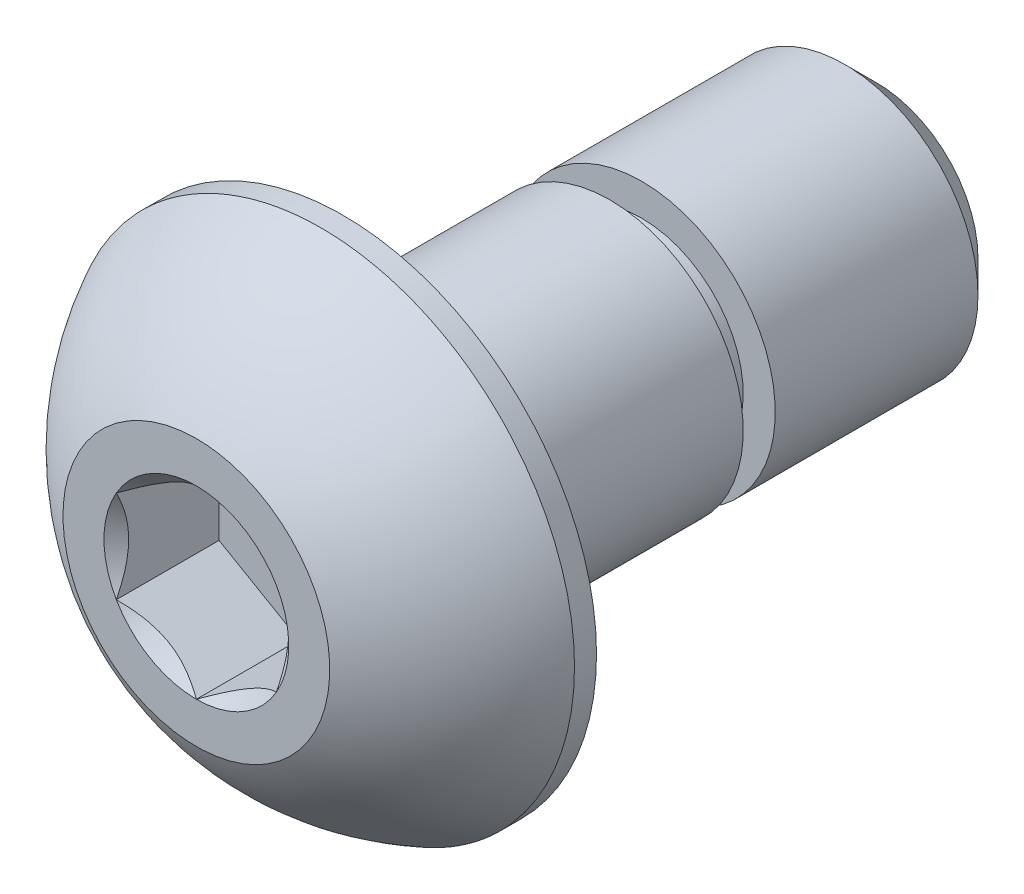
ISO-10303-21;
HEADER;
FILE_DESCRIPTION(('STEP AP214'),'2;1');
FILE_NAME('part.step','',(''),(''),'','','');
FILE_SCHEMA(('AUTOMOTIVE_DESIGN { 1 0 10303 214 1 1 1 1 }'));
ENDSEC;
DATA;
#1=APPLICATION_CONTEXT('core data for automotive mechanical design processes');
#2=APPLICATION_PROTOCOL_DEFINITION('international standard','automotive_design',2000,#1);
#3=PRODUCT_CONTEXT('',#1,'mechanical');
#4=PRODUCT('Part','Part','',(#3));
#5=PRODUCT_RELATED_PRODUCT_CATEGORY('part','',(#4));
#6=PRODUCT_DEFINITION_FORMATION('','',#4);
#7=PRODUCT_DEFINITION_CONTEXT('part definition',#1,'design');
#8=PRODUCT_DEFINITION('design','',#6,#7);
#9=PRODUCT_DEFINITION_SHAPE('','',#8);
#10=(LENGTH_UNIT() NAMED_UNIT(*) SI_UNIT(.MILLI.,.METRE.));
#11=(NAMED_UNIT(*) PLANE_ANGLE_UNIT() SI_UNIT($,.RADIAN.));
#12=(NAMED_UNIT(*) SI_UNIT($,.STERADIAN.) SOLID_ANGLE_UNIT());
#13=UNCERTAINTY_MEASURE_WITH_UNIT(LENGTH_MEASURE(1.E-05),#10,'distance_accuracy_value','');
#14=(GEOMETRIC_REPRESENTATION_CONTEXT(3) GLOBAL_UNCERTAINTY_ASSIGNED_CONTEXT((#13)) GLOBAL_UNIT_ASSIGNED_CONTEXT((#10,
#11,#12)) REPRESENTATION_CONTEXT('',''));
#15=CARTESIAN_POINT('',(0.,0.,0.));
#16=DIRECTION('',(0.,0.,1.));
#17=DIRECTION('',(1.,0.,0.));
#18=AXIS2_PLACEMENT_3D('',#15,#16,#17);
#19=CARTESIAN_POINT('',(1.5,-0.866025403784438,-1.925));
#20=DIRECTION('',(0.,0.,1.));
#21=DIRECTION('',(1.,0.,0.));
#22=AXIS2_PLACEMENT_3D('',#19,#20,#21);
#23=PLANE('',#22);
#24=DIRECTION('',(0.,-1.,0.));
#25=VECTOR('',#24,1.);
#26=CARTESIAN_POINT('',(-1.5,0.866025403784438,-1.925));
#27=LINE('',#26,#25);
#28=CARTESIAN_POINT('',(-1.5,0.866025403784439,-1.925));
#29=VERTEX_POINT('',#28);
#30=CARTESIAN_POINT('',(-1.5,-0.866025403784439,-1.925));
#31=VERTEX_POINT('',#30);
#32=EDGE_CURVE('E67',#29,#31,#27,.T.);
#33=ORIENTED_EDGE('',*,*,#32,.T.);
#34=DIRECTION('',(0.866025403784439,-0.5,0.));
#35=VECTOR('',#34,1.);
#36=CARTESIAN_POINT('',(-1.5,-0.866025403784439,-1.925));
#37=LINE('',#36,#35);
#38=CARTESIAN_POINT('',(0.,-1.73205080756888,-1.925));
#39=VERTEX_POINT('',#38);
#40=EDGE_CURVE('E81',#31,#39,#37,.T.);
#41=ORIENTED_EDGE('',*,*,#40,.T.);
#42=DIRECTION('',(0.866025403784438,0.5,0.));
#43=VECTOR('',#42,1.);
#44=CARTESIAN_POINT('',(0.,-1.73205080756888,-1.925));
#45=LINE('',#44,#43);
#46=CARTESIAN_POINT('',(1.5,-0.86602540378444,-1.925));
#47=VERTEX_POINT('',#46);
#48=EDGE_CURVE('E84',#39,#47,#45,.T.);
#49=ORIENTED_EDGE('',*,*,#48,.T.);
#50=DIRECTION('',(0.,1.,0.));
#51=VECTOR('',#50,1.);
#52=CARTESIAN_POINT('',(1.5,-0.866025403784438,-1.925));
#53=LINE('',#52,#51);
#54=CARTESIAN_POINT('',(1.5,0.866025403784439,-1.925));
#55=VERTEX_POINT('',#54);
#56=EDGE_CURVE('E93',#47,#55,#53,.T.);
#57=ORIENTED_EDGE('',*,*,#56,.T.);
#58=DIRECTION('',(-0.866025403784439,0.5,0.));
#59=VECTOR('',#58,1.);
#60=CARTESIAN_POINT('',(1.5,0.866025403784439,-1.925));
#61=LINE('',#60,#59);
#62=CARTESIAN_POINT('',(0.,1.73205080756888,-1.925));
#63=VERTEX_POINT('',#62);
#64=EDGE_CURVE('E293',#55,#63,#61,.T.);
#65=ORIENTED_EDGE('',*,*,#64,.T.);
#66=DIRECTION('',(-0.866025403784438,-0.5,0.));
#67=VECTOR('',#66,1.);
#68=CARTESIAN_POINT('',(0.,1.73205080756888,-1.925));
#69=LINE('',#68,#67);
#70=EDGE_CURVE('E72',#63,#29,#69,.T.);
#71=ORIENTED_EDGE('',*,*,#70,.T.);
#72=EDGE_LOOP('',(#33,#41,#49,#57,#65,#71));
#73=FACE_BOUND('',#72,.T.);
#74=ADVANCED_FACE('F17',(#73),#23,.T.);
#75=CARTESIAN_POINT('',(-1.5,-0.866025403784439,-1.925));
#76=DIRECTION('',(-0.5,-0.866025403784439,0.));
#77=DIRECTION('',(0.866025403784439,-0.5,0.));
#78=AXIS2_PLACEMENT_3D('',#75,#76,#77);
#79=PLANE('',#78);
#80=CARTESIAN_POINT('',(-1.50000000002453,-0.866025403770049,-3.49737783956075E-11));
#81=CARTESIAN_POINT('',(-1.44844426727117,-0.895791119953617,-0.0297371504849998));
#82=CARTESIAN_POINT('',(-1.39602652187328,-0.926054519369462,-0.05772749973321));
#83=CARTESIAN_POINT('',(-1.28914135977816,-0.987764696477501,-0.108976634295228));
#84=CARTESIAN_POINT('',(-1.23466378385068,-1.01921733960401,-0.132206913925155));
#85=CARTESIAN_POINT('',(-1.12481242363947,-1.08264005199279,-0.172000539063643));
#86=CARTESIAN_POINT('',(-1.06946660011449,-1.11459397810346,-0.188663877355987));
#87=CARTESIAN_POINT('',(-0.95755685533188,-1.17920509937865,-0.214336924391903));
#88=CARTESIAN_POINT('',(-0.900996350293105,-1.21186032218828,-0.223365789908325));
#89=CARTESIAN_POINT('',(-0.803509072843295,-1.26814462806649,-0.231512589340654));
#90=CARTESIAN_POINT('',(-0.762708138141556,-1.29170105869973,-0.232718117543908));
#91=CARTESIAN_POINT('',(-0.68117834074718,-1.33877230917235,-0.230683861819339));
#92=CARTESIAN_POINT('',(-0.640449495964758,-1.36228711867126,-0.22744309593466));
#93=CARTESIAN_POINT('',(-0.559384065201953,-1.40909026694414,-0.216702694706976));
#94=CARTESIAN_POINT('',(-0.519047879504411,-1.4323783746147,-0.20919909909419));
#95=CARTESIAN_POINT('',(-0.439052551258333,-1.47856369891149,-0.19034052638936));
#96=CARTESIAN_POINT('',(-0.399393706909127,-1.50146074337225,-0.178983896683506));
#97=CARTESIAN_POINT('',(-0.297850129661508,-1.56008695503064,-0.145281418581616));
#98=CARTESIAN_POINT('',(-0.236594120185608,-1.59545312859103,-0.120399016466317));
#99=CARTESIAN_POINT('',(-0.146523888893023,-1.64745520087378,-0.0783962697862533));
#100=CARTESIAN_POINT('',(-0.116842951449675,-1.6645914980965,-0.0636393457173693));
#101=CARTESIAN_POINT('',(-0.058026631022432,-1.69854911652791,-0.0327784720806822));
#102=CARTESIAN_POINT('',(-0.0288909964375007,-1.71537058299853,-0.0166751634684281));
#103=CARTESIAN_POINT('',(2.46569689539214E-11,-1.73205080758311,-3.50665873931199E-11));
#104=B_SPLINE_CURVE_WITH_KNOTS('',3,(#80,#81,#82,#83,#84,#85,#86,#87,#88,#89,#90,#91,#92,#93,
#94,#95,#96,#97,#98,#99,#100,#101,#102,#103),.UNSPECIFIED.,.F.,.F.,(4,2,2,2,2,2,2,2,2,2,2,4),
(0.,0.199774419910088,0.400712312277699,0.598459990337993,0.795709985707601,0.936894690871222,
1.07811058146816,1.21945788001607,1.36086588096647,1.58533909988034,1.69726364731887,
1.80913521242832),.UNSPECIFIED.);
#105=CARTESIAN_POINT('',(-1.50000000002135,-0.866025403796765,-2.4650955516094E-11));
#106=VERTEX_POINT('',#105);
#107=CARTESIAN_POINT('',(-3.03586137356069E-11,-1.73205080760065,-1.75293180706268E-11));
#108=VERTEX_POINT('',#107);
#109=EDGE_CURVE('E20',#106,#108,#104,.T.);
#110=ORIENTED_EDGE('',*,*,#109,.T.);
#111=DIRECTION('',(0.,0.,1.));
#112=VECTOR('',#111,1.);
#113=CARTESIAN_POINT('',(0.,-1.73205080756888,-1.925));
#114=LINE('',#113,#112);
#115=EDGE_CURVE('E88',#108,#39,#114,.F.);
#116=ORIENTED_EDGE('',*,*,#115,.T.);
#117=ORIENTED_EDGE('',*,*,#40,.F.);
#118=DIRECTION('',(0.,0.,1.));
#119=VECTOR('',#118,1.);
#120=CARTESIAN_POINT('',(-1.5,-0.866025403784439,-1.925));
#121=LINE('',#120,#119);
#122=EDGE_CURVE('E59',#31,#106,#121,.T.);
#123=ORIENTED_EDGE('',*,*,#122,.T.);
#124=EDGE_LOOP('',(#110,#116,#117,#123));
#125=FACE_BOUND('',#124,.T.);
#126=ADVANCED_FACE('F89',(#125),#79,.F.);
#127=CARTESIAN_POINT('',(0.,-1.73205080756888,-1.925));
#128=DIRECTION('',(0.5,-0.866025403784438,0.));
#129=DIRECTION('',(0.866025403784438,0.5,0.));
#130=AXIS2_PLACEMENT_3D('',#127,#128,#129);
#131=PLANE('',#130);
#132=CARTESIAN_POINT('',(-2.4727404427812E-11,-1.73205080758293,-3.49716199394019E-11));
#133=CARTESIAN_POINT('',(0.0515557327287643,-1.70228509139958,-0.0297371504849976));
#134=CARTESIAN_POINT('',(0.103973478126705,-1.67202169198382,-0.0577274997332079));
#135=CARTESIAN_POINT('',(0.210858640221864,-1.61031151487585,-0.108976634295226));
#136=CARTESIAN_POINT('',(0.26533621614933,-1.57885887174931,-0.132206913925153));
#137=CARTESIAN_POINT('',(0.375187576360525,-1.51543615936052,-0.172000539063641));
#138=CARTESIAN_POINT('',(0.430533399885509,-1.48348223324986,-0.188663877355985));
#139=CARTESIAN_POINT('',(0.542443144668123,-1.41887111197467,-0.214336924391901));
#140=CARTESIAN_POINT('',(0.599003649706897,-1.38621588916504,-0.223365789908323));
#141=CARTESIAN_POINT('',(0.696490927156707,-1.32993158328682,-0.231512589340651));
#142=CARTESIAN_POINT('',(0.737291861858446,-1.30637515265359,-0.232718117543906));
#143=CARTESIAN_POINT('',(0.818821659252822,-1.25930390218097,-0.230683861819337));
#144=CARTESIAN_POINT('',(0.859550504035244,-1.23578909268205,-0.227443095934657));
#145=CARTESIAN_POINT('',(0.940615934798049,-1.18898594440918,-0.216702694706973));
#146=CARTESIAN_POINT('',(0.980952120495592,-1.16569783673862,-0.209199099094188));
#147=CARTESIAN_POINT('',(1.06094744874167,-1.11951251244183,-0.190340526389357));
#148=CARTESIAN_POINT('',(1.10060629309088,-1.09661546798107,-0.178983896683504));
#149=CARTESIAN_POINT('',(1.20214987033849,-1.03798925632268,-0.145281418581613));
#150=CARTESIAN_POINT('',(1.26340587981439,-1.00262308276228,-0.120399016466315));
#151=CARTESIAN_POINT('',(1.35347611110698,-0.950621010479539,-0.0783962697862517));
#152=CARTESIAN_POINT('',(1.38315704855033,-0.933484713256821,-0.063639345717368));
#153=CARTESIAN_POINT('',(1.44197336897757,-0.89952709482541,-0.0327784720806814));
#154=CARTESIAN_POINT('',(1.4711090035625,-0.882705628354789,-0.0166751634684275));
#155=CARTESIAN_POINT('',(1.50000000002466,-0.866025403770207,-3.5066233129564E-11));
#156=B_SPLINE_CURVE_WITH_KNOTS('',3,(#132,#133,#134,#135,#136,#137,#138,#139,#140,#141,#142,
#143,#144,#145,#146,#147,#148,#149,#150,#151,#152,#153,#154,#155),.UNSPECIFIED.,.F.,.F.,(4,2,2,
2,2,2,2,2,2,2,2,4),(0.,0.199774419910088,0.400712312277699,0.598459990337993,0.795709985707601,
0.936894690871222,1.07811058146816,1.21945788001607,1.36086588096647,1.58533909988034,
1.69726364731887,1.80913521242832),.UNSPECIFIED.);
#157=CARTESIAN_POINT('',(1.50000000001233,-0.866025403826621,-1.75289960884086E-11));
#158=VERTEX_POINT('',#157);
#159=EDGE_CURVE('E219',#108,#158,#156,.T.);
#160=ORIENTED_EDGE('',*,*,#159,.T.);
#161=DIRECTION('',(0.,0.,-1.));
#162=VECTOR('',#161,1.);
#163=CARTESIAN_POINT('',(1.5,-0.866025403784439,-1.925));
#164=LINE('',#163,#162);
#165=EDGE_CURVE('E97',#158,#47,#164,.T.);
#166=ORIENTED_EDGE('',*,*,#165,.T.);
#167=ORIENTED_EDGE('',*,*,#48,.F.);
#168=ORIENTED_EDGE('',*,*,#115,.F.);
#169=EDGE_LOOP('',(#160,#166,#167,#168));
#170=FACE_BOUND('',#169,.T.);
#171=ADVANCED_FACE('F95',(#170),#131,.F.);
#172=CARTESIAN_POINT('',(1.5,-0.866025403784438,-1.925));
#173=DIRECTION('',(1.,0.,0.));
#174=DIRECTION('',(0.,0.,-1.));
#175=AXIS2_PLACEMENT_3D('',#172,#173,#174);
#176=PLANE('',#175);
#177=CARTESIAN_POINT('',(1.4999999999998,-0.866025403812882,-3.49731948477309E-11));
#178=CARTESIAN_POINT('',(1.49999999999993,-0.806493971458482,-0.0297371504859724));
#179=CARTESIAN_POINT('',(1.49999999999998,-0.745967172639481,-0.0577274997356717));
#180=CARTESIAN_POINT('',(1.50000000000002,-0.622546818448653,-0.108976634302055));
#181=CARTESIAN_POINT('',(1.50000000000001,-0.559641532208188,-0.132206913934863));
#182=CARTESIAN_POINT('',(1.5,-0.432796107455125,-0.172000539080811));
#183=CARTESIAN_POINT('',(1.5,-0.368888255245699,-0.188663877377684));
#184=CARTESIAN_POINT('',(1.5,-0.239666012718551,-0.214336924424236));
#185=CARTESIAN_POINT('',(1.5,-0.174355567110583,-0.223365789946761));
#186=CARTESIAN_POINT('',(1.5,-0.0617869553803685,-0.231512589389946));
#187=CARTESIAN_POINT('',(1.5,-0.0146740941290635,-0.232718117598397));
#188=CARTESIAN_POINT('',(1.5,0.0794684067864022,-0.230683861885897));
#189=CARTESIAN_POINT('',(1.5,0.126498025769628,-0.227443096008093));
#190=CARTESIAN_POINT('',(1.5,0.220104322286849,-0.216702694795371));
#191=CARTESIAN_POINT('',(1.5,0.266680537614033,-0.209199099190673));
#192=CARTESIAN_POINT('',(1.5,0.359051186180353,-0.190340526502742));
#193=CARTESIAN_POINT('',(1.5,0.404845275088565,-0.178983896805698));
#194=CARTESIAN_POINT('',(1.5,0.522097698449398,-0.145281418704612));
#195=CARTESIAN_POINT('',(1.5,0.592830045625335,-0.120399016572433));
#196=CARTESIAN_POINT('',(1.5,0.69683419026976,-0.0783962698582895));
#197=CARTESIAN_POINT('',(1.5,0.731106784740956,-0.0636393457765502));
#198=CARTESIAN_POINT('',(1.5,0.799022021654026,-0.0327784721118594));
#199=CARTESIAN_POINT('',(1.5,0.832664954619755,-0.0166751634844621));
#200=CARTESIAN_POINT('',(1.5,0.866025403812908,-3.50673015597961E-11));
#201=B_SPLINE_CURVE_WITH_KNOTS('',3,(#177,#178,#179,#180,#181,#182,#183,#184,#185,#186,#187,
#188,#189,#190,#191,#192,#193,#194,#195,#196,#197,#198,#199,#200),.UNSPECIFIED.,.F.,.F.,(4,2,2,
2,2,2,2,2,2,2,2,4),(0.,0.199774419877746,0.400712312213007,0.598459990242251,0.795709985580833,
0.936894690699464,1.07811058125136,1.21945787975417,1.36086588065946,1.58533909974464,
1.69726364726936,1.80913521246463),.UNSPECIFIED.);
#202=CARTESIAN_POINT('',(1.5000000000427,0.866025403774031,-1.75296333077756E-11));
#203=VERTEX_POINT('',#202);
#204=EDGE_CURVE('E198',#158,#203,#201,.T.);
#205=ORIENTED_EDGE('',*,*,#204,.T.);
#206=DIRECTION('',(0.,0.,1.));
#207=VECTOR('',#206,1.);
#208=CARTESIAN_POINT('',(1.5,0.866025403784439,-1.925));
#209=LINE('',#208,#207);
#210=EDGE_CURVE('E290',#203,#55,#209,.F.);
#211=ORIENTED_EDGE('',*,*,#210,.T.);
#212=ORIENTED_EDGE('',*,*,#56,.F.);
#213=ORIENTED_EDGE('',*,*,#165,.F.);
#214=EDGE_LOOP('',(#205,#211,#212,#213));
#215=FACE_BOUND('',#214,.T.);
#216=ADVANCED_FACE('F188',(#215),#176,.F.);
#217=CARTESIAN_POINT('',(1.5,0.866025403784439,-1.925));
#218=DIRECTION('',(0.5,0.866025403784439,0.));
#219=DIRECTION('',(-0.866025403784439,0.5,0.));
#220=AXIS2_PLACEMENT_3D('',#217,#218,#219);
#221=PLANE('',#220);
#222=CARTESIAN_POINT('',(1.50000000002453,0.866025403770048,-3.4973253111955E-11));
#223=CARTESIAN_POINT('',(1.44844426727117,0.895791119953617,-0.0297371504849995));
#224=CARTESIAN_POINT('',(1.39602652187328,0.926054519369461,-0.0577274997332099));
#225=CARTESIAN_POINT('',(1.28914135977816,0.987764696477501,-0.108976634295228));
#226=CARTESIAN_POINT('',(1.23466378385068,1.01921733960401,-0.132206913925156));
#227=CARTESIAN_POINT('',(1.12481242363947,1.08264005199279,-0.172000539063644));
#228=CARTESIAN_POINT('',(1.06946660011449,1.11459397810346,-0.188663877355987));
#229=CARTESIAN_POINT('',(0.95755685533188,1.17920509937865,-0.214336924391904));
#230=CARTESIAN_POINT('',(0.900996350293105,1.21186032218828,-0.223365789908325));
#231=CARTESIAN_POINT('',(0.803509072843295,1.26814462806649,-0.231512589340654));
#232=CARTESIAN_POINT('',(0.762708138141556,1.29170105869973,-0.232718117543908));
#233=CARTESIAN_POINT('',(0.68117834074718,1.33877230917235,-0.230683861819339));
#234=CARTESIAN_POINT('',(0.640449495964758,1.36228711867126,-0.22744309593466));
#235=CARTESIAN_POINT('',(0.559384065201953,1.40909026694414,-0.216702694706976));
#236=CARTESIAN_POINT('',(0.51904787950441,1.4323783746147,-0.20919909909419));
#237=CARTESIAN_POINT('',(0.439052551258333,1.47856369891149,-0.19034052638936));
#238=CARTESIAN_POINT('',(0.399393706909126,1.50146074337225,-0.178983896683506));
#239=CARTESIAN_POINT('',(0.297850129661508,1.56008695503064,-0.145281418581616));
#240=CARTESIAN_POINT('',(0.236594120185608,1.59545312859103,-0.120399016466317));
#241=CARTESIAN_POINT('',(0.146523888893023,1.64745520087378,-0.0783962697862533));
#242=CARTESIAN_POINT('',(0.116842951449675,1.6645914980965,-0.0636393457173695));
#243=CARTESIAN_POINT('',(0.0580266310224324,1.69854911652791,-0.0327784720806825));
#244=CARTESIAN_POINT('',(0.0288909964375013,1.71537058299853,-0.0166751634684285));
#245=CARTESIAN_POINT('',(-2.46561764620561E-11,1.73205080758311,-3.50669956446036E-11));
#246=B_SPLINE_CURVE_WITH_KNOTS('',3,(#222,#223,#224,#225,#226,#227,#228,#229,#230,#231,#232,
#233,#234,#235,#236,#237,#238,#239,#240,#241,#242,#243,#244,#245),.UNSPECIFIED.,.F.,.F.,(4,2,2,
2,2,2,2,2,2,2,2,4),(0.,0.199774419910088,0.400712312277699,0.598459990337994,0.795709985707602,
0.936894690871222,1.07811058146816,1.21945788001607,1.36086588096647,1.58533909988034,
1.69726364731887,1.80913521242832),.UNSPECIFIED.);
#247=CARTESIAN_POINT('',(3.03595659452686E-11,1.73205080760065,-1.75295301999691E-11));
#248=VERTEX_POINT('',#247);
#249=EDGE_CURVE('E192',#203,#248,#246,.T.);
#250=ORIENTED_EDGE('',*,*,#249,.T.);
#251=DIRECTION('',(0.,0.,1.));
#252=VECTOR('',#251,1.);
#253=CARTESIAN_POINT('',(0.,1.73205080756888,-1.925));
#254=LINE('',#253,#252);
#255=EDGE_CURVE('E285',#248,#63,#254,.F.);
#256=ORIENTED_EDGE('',*,*,#255,.T.);
#257=ORIENTED_EDGE('',*,*,#64,.F.);
#258=ORIENTED_EDGE('',*,*,#210,.F.);
#259=EDGE_LOOP('',(#250,#256,#257,#258));
#260=FACE_BOUND('',#259,.T.);
#261=ADVANCED_FACE('F184',(#260),#221,.F.);
#262=CARTESIAN_POINT('',(0.,1.73205080756888,-1.925));
#263=DIRECTION('',(-0.5,0.866025403784438,0.));
#264=DIRECTION('',(-0.866025403784438,-0.5,0.));
#265=AXIS2_PLACEMENT_3D('',#262,#263,#264);
#266=PLANE('',#265);
#267=CARTESIAN_POINT('',(2.47285824502275E-11,1.73205080758293,-3.4971456143468E-11));
#268=CARTESIAN_POINT('',(-0.0515557327287631,1.70228509139958,-0.0297371504849978));
#269=CARTESIAN_POINT('',(-0.103973478126704,1.67202169198382,-0.057727499733208));
#270=CARTESIAN_POINT('',(-0.210858640221863,1.61031151487585,-0.108976634295226));
#271=CARTESIAN_POINT('',(-0.265336216149329,1.57885887174931,-0.132206913925153));
#272=CARTESIAN_POINT('',(-0.375187576360524,1.51543615936052,-0.172000539063641));
#273=CARTESIAN_POINT('',(-0.430533399885509,1.48348223324986,-0.188663877355985));
#274=CARTESIAN_POINT('',(-0.542443144668122,1.41887111197467,-0.214336924391902));
#275=CARTESIAN_POINT('',(-0.599003649706897,1.38621588916503,-0.223365789908323));
#276=CARTESIAN_POINT('',(-0.696490927156706,1.32993158328682,-0.231512589340652));
#277=CARTESIAN_POINT('',(-0.737291861858445,1.30637515265359,-0.232718117543906));
#278=CARTESIAN_POINT('',(-0.818821659252821,1.25930390218097,-0.230683861819337));
#279=CARTESIAN_POINT('',(-0.859550504035243,1.23578909268205,-0.227443095934658));
#280=CARTESIAN_POINT('',(-0.940615934798048,1.18898594440918,-0.216702694706974));
#281=CARTESIAN_POINT('',(-0.980952120495591,1.16569783673862,-0.209199099094188));
#282=CARTESIAN_POINT('',(-1.06094744874167,1.11951251244183,-0.190340526389358));
#283=CARTESIAN_POINT('',(-1.10060629309088,1.09661546798107,-0.178983896683504));
#284=CARTESIAN_POINT('',(-1.20214987033849,1.03798925632268,-0.145281418581613));
#285=CARTESIAN_POINT('',(-1.26340587981439,1.00262308276228,-0.120399016466315));
#286=CARTESIAN_POINT('',(-1.35347611110698,0.950621010479538,-0.0783962697862518));
#287=CARTESIAN_POINT('',(-1.38315704855033,0.933484713256821,-0.0636393457173682));
#288=CARTESIAN_POINT('',(-1.44197336897757,0.899527094825409,-0.0327784720806815));
#289=CARTESIAN_POINT('',(-1.4711090035625,0.882705628354789,-0.0166751634684275));
#290=CARTESIAN_POINT('',(-1.50000000002466,0.866025403770206,-3.50659949264669E-11));
#291=B_SPLINE_CURVE_WITH_KNOTS('',3,(#267,#268,#269,#270,#271,#272,#273,#274,#275,#276,#277,
#278,#279,#280,#281,#282,#283,#284,#285,#286,#287,#288,#289,#290),.UNSPECIFIED.,.F.,.F.,(4,2,2,
2,2,2,2,2,2,2,2,4),(0.,0.199774419910088,0.400712312277699,0.598459990337994,0.795709985707602,
0.936894690871222,1.07811058146816,1.21945788001607,1.36086588096647,1.58533909988034,
1.69726364731887,1.80913521242832),.UNSPECIFIED.);
#292=CARTESIAN_POINT('',(-1.50000000001234,0.86602540382662,-1.75291186124796E-11));
#293=VERTEX_POINT('',#292);
#294=EDGE_CURVE('E40',#248,#293,#291,.T.);
#295=ORIENTED_EDGE('',*,*,#294,.T.);
#296=DIRECTION('',(0.,0.,1.));
#297=VECTOR('',#296,1.);
#298=CARTESIAN_POINT('',(-1.5,0.866025403784438,-1.925));
#299=LINE('',#298,#297);
#300=EDGE_CURVE('E278',#293,#29,#299,.F.);
#301=ORIENTED_EDGE('',*,*,#300,.T.);
#302=ORIENTED_EDGE('',*,*,#70,.F.);
#303=ORIENTED_EDGE('',*,*,#255,.F.);
#304=EDGE_LOOP('',(#295,#301,#302,#303));
#305=FACE_BOUND('',#304,.T.);
#306=ADVANCED_FACE('F179',(#305),#266,.F.);
#307=CARTESIAN_POINT('',(-1.5,0.866025403784438,-1.925));
#308=DIRECTION('',(-1.,0.,0.));
#309=DIRECTION('',(0.,-1.,0.));
#310=AXIS2_PLACEMENT_3D('',#307,#308,#309);
#311=PLANE('',#310);
#312=CARTESIAN_POINT('',(-1.4999999999998,0.866025403812881,-3.4973747365913E-11));
#313=CARTESIAN_POINT('',(-1.49999999999993,0.806493971458482,-0.0297371504859728));
#314=CARTESIAN_POINT('',(-1.49999999999998,0.74596717263948,-0.0577274997356719));
#315=CARTESIAN_POINT('',(-1.50000000000002,0.622546818448652,-0.108976634302056));
#316=CARTESIAN_POINT('',(-1.50000000000001,0.559641532208187,-0.132206913934863));
#317=CARTESIAN_POINT('',(-1.5,0.432796107455125,-0.172000539080811));
#318=CARTESIAN_POINT('',(-1.5,0.368888255245698,-0.188663877377684));
#319=CARTESIAN_POINT('',(-1.5,0.239666012718551,-0.214336924424236));
#320=CARTESIAN_POINT('',(-1.5,0.174355567110582,-0.223365789946761));
#321=CARTESIAN_POINT('',(-1.5,0.0617869553803678,-0.231512589389946));
#322=CARTESIAN_POINT('',(-1.5,0.0146740941290628,-0.232718117598397));
#323=CARTESIAN_POINT('',(-1.5,-0.079468406786403,-0.230683861885897));
#324=CARTESIAN_POINT('',(-1.5,-0.126498025769629,-0.227443096008092));
#325=CARTESIAN_POINT('',(-1.5,-0.220104322286849,-0.21670269479537));
#326=CARTESIAN_POINT('',(-1.5,-0.266680537614034,-0.209199099190673));
#327=CARTESIAN_POINT('',(-1.5,-0.359051186180354,-0.190340526502742));
#328=CARTESIAN_POINT('',(-1.5,-0.404845275088565,-0.178983896805698));
#329=CARTESIAN_POINT('',(-1.5,-0.522097698449399,-0.145281418704611));
#330=CARTESIAN_POINT('',(-1.5,-0.592830045625336,-0.120399016572433));
#331=CARTESIAN_POINT('',(-1.5,-0.69683419026976,-0.0783962698582891));
#332=CARTESIAN_POINT('',(-1.5,-0.731106784740957,-0.0636393457765498));
#333=CARTESIAN_POINT('',(-1.5,-0.799022021654027,-0.0327784721118589));
#334=CARTESIAN_POINT('',(-1.5,-0.832664954619756,-0.0166751634844615));
#335=CARTESIAN_POINT('',(-1.5,-0.866025403812909,-3.50666750779327E-11));
#336=B_SPLINE_CURVE_WITH_KNOTS('',3,(#312,#313,#314,#315,#316,#317,#318,#319,#320,#321,#322,
#323,#324,#325,#326,#327,#328,#329,#330,#331,#332,#333,#334,#335),.UNSPECIFIED.,.F.,.F.,(4,2,2,
2,2,2,2,2,2,2,2,4),(0.,0.199774419877746,0.400712312213007,0.59845999024225,0.795709985580832,
0.936894690699464,1.07811058125136,1.21945787975417,1.36086588065945,1.58533909974464,
1.69726364726936,1.80913521246463),.UNSPECIFIED.);
#337=EDGE_CURVE('E158',#293,#106,#336,.T.);
#338=ORIENTED_EDGE('',*,*,#337,.T.);
#339=ORIENTED_EDGE('',*,*,#122,.F.);
#340=ORIENTED_EDGE('',*,*,#32,.F.);
#341=ORIENTED_EDGE('',*,*,#300,.F.);
#342=EDGE_LOOP('',(#338,#339,#340,#341));
#343=FACE_BOUND('',#342,.T.);
#344=ADVANCED_FACE('F174',(#343),#311,.F.);
#345=CARTESIAN_POINT('',(0.,-2.50000000000007,-12.7500000000001));
#346=DIRECTION('',(0.,0.,-1.));
#347=DIRECTION('',(0.,1.,0.));
#348=AXIS2_PLACEMENT_3D('',#345,#346,#347);
#349=PLANE('',#348);
#350=CARTESIAN_POINT('',(0.,0.,-12.7499999999258));
#351=DIRECTION('',(0.,0.,1.));
#352=DIRECTION('',(1.,0.,0.));
#353=AXIS2_PLACEMENT_3D('',#350,#351,#352);
#354=CIRCLE('',#353,1.89999999992096);
#355=CARTESIAN_POINT('',(1.89999999992096,0.,-12.7499999999258));
#356=VERTEX_POINT('',#355);
#357=EDGE_CURVE('E166',#356,#356,#354,.T.);
#358=ORIENTED_EDGE('',*,*,#357,.F.);
#359=EDGE_LOOP('',(#358));
#360=FACE_BOUND('',#359,.T.);
#361=ADVANCED_FACE('F178',(#360),#349,.T.);
#362=CARTESIAN_POINT('',(0.,0.,0.));
#363=DIRECTION('',(0.,0.,1.));
#364=DIRECTION('',(1.,0.,0.));
#365=AXIS2_PLACEMENT_3D('',#362,#363,#364);
#366=CONICAL_SURFACE('',#365,1.73205080761818,0.785398163519197);
#367=ORIENTED_EDGE('',*,*,#109,.F.);
#368=CARTESIAN_POINT('',(0.,0.,0.));
#369=DIRECTION('',(0.,0.,1.));
#370=DIRECTION('',(1.,0.,0.));
#371=AXIS2_PLACEMENT_3D('',#368,#369,#370);
#372=CIRCLE('',#371,1.73205080761818);
#373=EDGE_CURVE('E323',#106,#108,#372,.T.);
#374=ORIENTED_EDGE('',*,*,#373,.T.);
#375=EDGE_LOOP('',(#367,#374));
#376=FACE_BOUND('',#375,.T.);
#377=ADVANCED_FACE('F216',(#376),#366,.F.);
#378=CARTESIAN_POINT('',(0.,0.,0.));
#379=DIRECTION('',(0.,0.,1.));
#380=DIRECTION('',(1.,0.,0.));
#381=AXIS2_PLACEMENT_3D('',#378,#379,#380);
#382=CONICAL_SURFACE('',#381,1.73205080761818,0.785398163519197);
#383=ORIENTED_EDGE('',*,*,#159,.F.);
#384=CARTESIAN_POINT('',(0.,0.,0.));
#385=DIRECTION('',(0.,0.,1.));
#386=DIRECTION('',(1.,0.,0.));
#387=AXIS2_PLACEMENT_3D('',#384,#385,#386);
#388=CIRCLE('',#387,1.73205080761818);
#389=EDGE_CURVE('E330',#108,#158,#388,.T.);
#390=ORIENTED_EDGE('',*,*,#389,.T.);
#391=EDGE_LOOP('',(#383,#390));
#392=FACE_BOUND('',#391,.T.);
#393=ADVANCED_FACE('F212',(#392),#382,.F.);
#394=CARTESIAN_POINT('',(0.,0.,0.));
#395=DIRECTION('',(0.,0.,1.));
#396=DIRECTION('',(1.,0.,0.));
#397=AXIS2_PLACEMENT_3D('',#394,#395,#396);
#398=CONICAL_SURFACE('',#397,1.73205080761818,0.785398163397448);
#399=CARTESIAN_POINT('',(0.,0.,0.));
#400=DIRECTION('',(0.,0.,1.));
#401=DIRECTION('',(1.,0.,0.));
#402=AXIS2_PLACEMENT_3D('',#399,#400,#401);
#403=CIRCLE('',#402,1.73205080761818);
#404=EDGE_CURVE('E331',#158,#203,#403,.T.);
#405=ORIENTED_EDGE('',*,*,#404,.T.);
#406=ORIENTED_EDGE('',*,*,#204,.F.);
#407=EDGE_LOOP('',(#405,#406));
#408=FACE_BOUND('',#407,.T.);
#409=ADVANCED_FACE('F207',(#408),#398,.F.);
#410=CARTESIAN_POINT('',(0.,0.,0.));
#411=DIRECTION('',(0.,0.,1.));
#412=DIRECTION('',(1.,0.,0.));
#413=AXIS2_PLACEMENT_3D('',#410,#411,#412);
#414=CONICAL_SURFACE('',#413,1.73205080761818,0.785398163519197);
#415=ORIENTED_EDGE('',*,*,#249,.F.);
#416=CARTESIAN_POINT('',(0.,0.,0.));
#417=DIRECTION('',(0.,0.,1.));
#418=DIRECTION('',(1.,0.,0.));
#419=AXIS2_PLACEMENT_3D('',#416,#417,#418);
#420=CIRCLE('',#419,1.73205080761818);
#421=EDGE_CURVE('E336',#203,#248,#420,.T.);
#422=ORIENTED_EDGE('',*,*,#421,.T.);
#423=EDGE_LOOP('',(#415,#422));
#424=FACE_BOUND('',#423,.T.);
#425=ADVANCED_FACE('F204',(#424),#414,.F.);
#426=CARTESIAN_POINT('',(0.,0.,0.));
#427=DIRECTION('',(0.,0.,1.));
#428=DIRECTION('',(1.,0.,0.));
#429=AXIS2_PLACEMENT_3D('',#426,#427,#428);
#430=CONICAL_SURFACE('',#429,1.73205080761818,0.785398163519197);
#431=ORIENTED_EDGE('',*,*,#294,.F.);
#432=CARTESIAN_POINT('',(0.,0.,0.));
#433=DIRECTION('',(0.,0.,1.));
#434=DIRECTION('',(1.,0.,0.));
#435=AXIS2_PLACEMENT_3D('',#432,#433,#434);
#436=CIRCLE('',#435,1.73205080761818);
#437=EDGE_CURVE('E275',#248,#293,#436,.T.);
#438=ORIENTED_EDGE('',*,*,#437,.T.);
#439=EDGE_LOOP('',(#431,#438));
#440=FACE_BOUND('',#439,.T.);
#441=ADVANCED_FACE('F153',(#440),#430,.F.);
#442=CARTESIAN_POINT('',(0.,0.,0.));
#443=DIRECTION('',(0.,0.,1.));
#444=DIRECTION('',(1.,0.,0.));
#445=AXIS2_PLACEMENT_3D('',#442,#443,#444);
#446=CONICAL_SURFACE('',#445,1.73205080761818,0.785398163397448);
#447=ORIENTED_EDGE('',*,*,#337,.F.);
#448=CARTESIAN_POINT('',(0.,0.,0.));
#449=DIRECTION('',(0.,0.,1.));
#450=DIRECTION('',(1.,0.,0.));
#451=AXIS2_PLACEMENT_3D('',#448,#449,#450);
#452=CIRCLE('',#451,1.73205080761818);
#453=EDGE_CURVE('E132',#293,#106,#452,.T.);
#454=ORIENTED_EDGE('',*,*,#453,.T.);
#455=EDGE_LOOP('',(#447,#454));
#456=FACE_BOUND('',#455,.T.);
#457=ADVANCED_FACE('F148',(#456),#446,.F.);
#458=CARTESIAN_POINT('',(0.,0.,-12.1500000000196));
#459=DIRECTION('',(0.,0.,1.));
#460=DIRECTION('',(1.,0.,0.));
#461=AXIS2_PLACEMENT_3D('',#458,#459,#460);
#462=CONICAL_SURFACE('',#461,2.49999999982713,0.785398163397448);
#463=ORIENTED_EDGE('',*,*,#357,.T.);
#464=EDGE_LOOP('',(#463));
#465=FACE_BOUND('',#464,.T.);
#466=CARTESIAN_POINT('',(0.,0.,-12.1500000000001));
#467=DIRECTION('',(0.,0.,1.));
#468=DIRECTION('',(0.,-1.,0.));
#469=AXIS2_PLACEMENT_3D('',#466,#467,#468);
#470=CIRCLE('',#469,2.5);
#471=CARTESIAN_POINT('',(0.,-2.5,-12.1500000000001));
#472=VERTEX_POINT('',#471);
#473=EDGE_CURVE('E131',#472,#472,#470,.T.);
#474=ORIENTED_EDGE('',*,*,#473,.F.);
#475=EDGE_LOOP('',(#474));
#476=FACE_BOUND('',#475,.T.);
#477=ADVANCED_FACE('F144',(#465,#476),#462,.T.);
#478=CARTESIAN_POINT('',(0.,-2.5,0.));
#479=DIRECTION('',(0.,0.,-1.));
#480=DIRECTION('',(-1.,0.,0.));
#481=AXIS2_PLACEMENT_3D('',#478,#479,#480);
#482=PLANE('',#481);
#483=ORIENTED_EDGE('',*,*,#437,.F.);
#484=ORIENTED_EDGE('',*,*,#421,.F.);
#485=ORIENTED_EDGE('',*,*,#404,.F.);
#486=ORIENTED_EDGE('',*,*,#389,.F.);
#487=ORIENTED_EDGE('',*,*,#373,.F.);
#488=ORIENTED_EDGE('',*,*,#453,.F.);
#489=EDGE_LOOP('',(#483,#484,#485,#486,#487,#488));
#490=FACE_BOUND('',#489,.T.);
#491=CARTESIAN_POINT('',(0.,2.5,0.));
#492=CARTESIAN_POINT('',(-0.140426104916171,2.49999377288615,0.));
#493=CARTESIAN_POINT('',(-0.280954031991962,2.48812860484106,3.15786606079497E-13));
#494=CARTESIAN_POINT('',(-0.558139658492382,2.44096074902969,-3.16166902160035E-13));
#495=CARTESIAN_POINT('',(-0.694792493265144,2.40562985309161,-1.1991938830655E-12));
#496=CARTESIAN_POINT('',(-0.960172122561447,2.31253633023374,-1.20166281841789E-12));
#497=CARTESIAN_POINT('',(-1.08890266852496,2.25478441650809,-3.21946211567848E-13));
#498=CARTESIAN_POINT('',(-1.33480476215494,2.11850293856875,3.21866212850881E-13));
#499=CARTESIAN_POINT('',(-1.45197917410753,2.03997854084975,0.));
#500=CARTESIAN_POINT('',(-1.67149637287936,1.86436525899232,0.));
#501=CARTESIAN_POINT('',(-1.77383760642256,1.76727443311113,0.));
#502=CARTESIAN_POINT('',(-1.96077108972063,1.5572853703438,0.));
#503=CARTESIAN_POINT('',(-2.04536264247664,1.44438651299413,0.));
#504=CARTESIAN_POINT('',(-2.19438926048053,1.20599153577205,0.));
#505=CARTESIAN_POINT('',(-2.2588247010994,1.08049565055392,0.));
#506=CARTESIAN_POINT('',(-2.36571190425968,0.820467575206643,0.));
#507=CARTESIAN_POINT('',(-2.40816371100576,0.685935403248266,0.));
#508=CARTESIAN_POINT('',(-2.46987884513361,0.411653235766082,0.));
#509=CARTESIAN_POINT('',(-2.4891421283097,0.271903230295727,0.));
#510=CARTESIAN_POINT('',(-2.50393321907299,-0.00884700938585592,0.));
#511=CARTESIAN_POINT('',(-2.49946106942909,-0.149847241343843,0.));
#512=CARTESIAN_POINT('',(-2.46690834048228,-0.429095661105701,0.));
#513=CARTESIAN_POINT('',(-2.43882775236998,-0.567343847882636,0.));
#514=CARTESIAN_POINT('',(-2.35985521676827,-0.837163810231989,0.));
#515=CARTESIAN_POINT('',(-2.30896324519902,-0.968735578756572,0.));
#516=CARTESIAN_POINT('',(-2.1858126315262,-1.2214675666181,0.));
#517=CARTESIAN_POINT('',(-2.11355399637579,-1.34262778934316,0.));
#518=CARTESIAN_POINT('',(-1.94972129370707,-1.57109730355804,0.));
#519=CARTESIAN_POINT('',(-1.85814723400701,-1.67840660065422,0.));
#520=CARTESIAN_POINT('',(-1.65828316813495,-1.87612814061528,0.));
#521=CARTESIAN_POINT('',(-1.54999315967219,-1.96654038116456,0.));
#522=CARTESIAN_POINT('',(-1.31977122488187,-2.12790126296045,0.));
#523=CARTESIAN_POINT('',(-1.19783929677156,-2.1988499016635,0.));
#524=CARTESIAN_POINT('',(-0.943794829063063,-2.31926953799948,0.));
#525=CARTESIAN_POINT('',(-0.811682289900767,-2.36874053655201,0.));
#526=CARTESIAN_POINT('',(-0.541026888337529,-2.44480055905628,0.));
#527=CARTESIAN_POINT('',(-0.402484026226278,-2.47138958403887,0.));
#528=CARTESIAN_POINT('',(-0.122900797575727,-2.50093087897621,0.));
#529=CARTESIAN_POINT('',(0.018139568963571,-2.50388314893098,3.46961945081868E-13));
#530=CARTESIAN_POINT('',(0.298714091660324,-2.48606712714886,-3.46961960712715E-13));
#531=CARTESIAN_POINT('',(0.438248247749923,-2.46529883434335,-1.29477243391078E-12));
#532=CARTESIAN_POINT('',(0.71184938433979,-2.40063123468837,-1.13730987603765E-12));
#533=CARTESIAN_POINT('',(0.845916364605969,-2.3567319268485,0.));
#534=CARTESIAN_POINT('',(1.10477735834655,-2.24704847617179,0.));
#535=CARTESIAN_POINT('',(1.22957137303277,-2.18126433619494,-1.00916257566668E-12));
#536=CARTESIAN_POINT('',(1.46634390401786,-2.02967864834022,-1.18352788602047E-12));
#537=CARTESIAN_POINT('',(1.57832242207297,-1.94387710320556,-3.16694129312418E-13));
#538=CARTESIAN_POINT('',(1.7862852822064,-1.7546922142879,3.16694257499622E-13));
#539=CARTESIAN_POINT('',(1.8822696178108,-1.6513088633884,0.));
#540=CARTESIAN_POINT('',(2.0555193719421,-1.42989510132749,0.));
#541=CARTESIAN_POINT('',(2.13278478437748,-1.31186468539964,0.));
#542=CARTESIAN_POINT('',(2.2664032406088,-1.06450749101074,0.));
#543=CARTESIAN_POINT('',(2.32275630647994,-0.935180724474358,0.));
#544=CARTESIAN_POINT('',(2.41295047224872,-0.668901974735227,0.));
#545=CARTESIAN_POINT('',(2.4467915805466,-0.531949994377823,0.));
#546=CARTESIAN_POINT('',(2.49100125494042,-0.254308178115883,0.));
#547=CARTESIAN_POINT('',(2.50136977874099,-0.113618335476538,0.));
#548=CARTESIAN_POINT('',(2.49833983643023,0.167504919749228,0.));
#549=CARTESIAN_POINT('',(2.48494141562714,0.307938332823985,0.));
#550=CARTESIAN_POINT('',(2.43475793877014,0.584562794538377,0.));
#551=CARTESIAN_POINT('',(2.39797283569016,0.720753834646849,0.));
#552=CARTESIAN_POINT('',(2.30205936796063,0.985029646530051,0.));
#553=CARTESIAN_POINT('',(2.24293058718862,1.11311426728121,0.));
#554=CARTESIAN_POINT('',(2.10401075902967,1.3575336098139,0.));
#555=CARTESIAN_POINT('',(2.02422052292125,1.47386879269155,0.));
#556=CARTESIAN_POINT('',(1.84625229096995,1.69148114008358,0.));
#557=CARTESIAN_POINT('',(1.74807621990901,1.79275987884253,0.));
#558=CARTESIAN_POINT('',(1.53608575842464,1.97742315380663,0.));
#559=CARTESIAN_POINT('',(1.42226748721669,2.06080323621403,0.));
#560=CARTESIAN_POINT('',(1.18220372565671,2.20730286771332,0.));
#561=CARTESIAN_POINT('',(1.05595232774905,2.27041272419885,0.));
#562=CARTESIAN_POINT('',(0.79474524318476,2.37446817640477,0.));
#563=CARTESIAN_POINT('',(0.659800208998089,2.41544034072841,0.));
#564=CARTESIAN_POINT('',(0.436662637238998,2.46313736176947,0.));
#565=CARTESIAN_POINT('',(0.349919997758221,2.47694359911888,0.));
#566=CARTESIAN_POINT('',(0.175464826042706,2.49537686389633,0.));
#567=CARTESIAN_POINT('',(0.0877522938079665,2.50000389132438,0.));
#568=CARTESIAN_POINT('',(0.,2.5,0.));
#569=B_SPLINE_CURVE_WITH_KNOTS('',3,(#491,#492,#493,#494,#495,#496,#497,#498,#499,#500,#501,
#502,#503,#504,#505,#506,#507,#508,#509,#510,#511,#512,#513,#514,#515,#516,#517,#518,#519,#520,
#521,#522,#523,#524,#525,#526,#527,#528,#529,#530,#531,#532,#533,#534,#535,#536,#537,#538,#539,
#540,#541,#542,#543,#544,#545,#546,#547,#548,#549,#550,#551,#552,#553,#554,#555,#556,#557,#558,
#559,#560,#561,#562,#563,#564,#565,#566,#567,#568),.UNSPECIFIED.,.T.,.F.,(4,2,2,2,2,2,2,2,2,2,2,
2,2,2,2,2,2,2,2,2,2,2,2,2,2,2,2,2,2,2,2,2,2,2,2,2,2,2,4),(0.,0.420958019059748,
0.842422990224611,1.26368682467408,1.68484598149402,2.10604920874208,2.52726897280856,
2.94848089195443,3.36969196412426,3.7909038392729,4.21211495543997,4.63332622878055,
5.05453794675567,5.47574952765963,5.89696093807138,6.31817240620663,6.73938392938708,
7.16059543453285,7.58180692070278,8.00301840687236,8.42422991201778,8.84544143519829,
9.26665290333358,9.68786431374594,10.1090758946506,10.5302876126258,10.9514988859663,
11.3727100021334,11.793921877282,12.2151329494518,12.6363448685977,13.0575646326643,
13.4787678599123,13.8999270167319,14.3211908511815,14.742655822347,15.1636138414069,
15.4266705700074,15.689727298608),.UNSPECIFIED.);
#570=CARTESIAN_POINT('',(0.,2.5,0.));
#571=VERTEX_POINT('',#570);
#572=EDGE_CURVE('E123',#571,#571,#569,.F.);
#573=ORIENTED_EDGE('',*,*,#572,.F.);
#574=EDGE_LOOP('',(#573));
#575=FACE_BOUND('',#574,.T.);
#576=ADVANCED_FACE('F139',(#490,#575),#482,.F.);
#577=CARTESIAN_POINT('',(0.,0.,-32.75));
#578=DIRECTION('',(0.,0.,1.));
#579=DIRECTION('',(0.,-1.,0.));
#580=AXIS2_PLACEMENT_3D('',#577,#578,#579);
#581=CYLINDRICAL_SURFACE('',#580,2.5);
#582=ORIENTED_EDGE('',*,*,#473,.T.);
#583=EDGE_LOOP('',(#582));
#584=FACE_BOUND('',#583,.T.);
#585=CARTESIAN_POINT('',(0.,0.,-8.3500002394831));
#586=DIRECTION('',(0.,0.,1.));
#587=DIRECTION('',(0.,-1.,0.));
#588=AXIS2_PLACEMENT_3D('',#585,#586,#587);
#589=CIRCLE('',#588,2.5);
#590=CARTESIAN_POINT('',(0.,-2.50000000000001,-8.3500002394831));
#591=VERTEX_POINT('',#590);
#592=EDGE_CURVE('E120',#591,#591,#589,.F.);
#593=ORIENTED_EDGE('',*,*,#592,.T.);
#594=EDGE_LOOP('',(#593));
#595=FACE_BOUND('',#594,.T.);
#596=ADVANCED_FACE('F143',(#584,#595),#581,.T.);
#597=CARTESIAN_POINT('',(0.,0.,-4.65805481283422));
#598=DIRECTION('',(0.,-1.,0.));
#599=DIRECTION('',(0.,0.,-1.));
#600=AXIS2_PLACEMENT_3D('',#597,#598,#599);
#601=SPHERICAL_SURFACE('',#600,5.28653711226622);
#602=ORIENTED_EDGE('',*,*,#572,.T.);
#603=EDGE_LOOP('',(#602));
#604=FACE_BOUND('',#603,.T.);
#605=CARTESIAN_POINT('',(0.,0.,-2.3375));
#606=DIRECTION('',(0.,0.,1.));
#607=DIRECTION('',(1.,0.,0.));
#608=AXIS2_PLACEMENT_3D('',#605,#606,#607);
#609=CIRCLE('',#608,4.75);
#610=CARTESIAN_POINT('',(4.75,0.,-2.3375));
#611=VERTEX_POINT('',#610);
#612=EDGE_CURVE('E117',#611,#611,#609,.F.);
#613=ORIENTED_EDGE('',*,*,#612,.F.);
#614=EDGE_LOOP('',(#613));
#615=FACE_BOUND('',#614,.T.);
#616=ADVANCED_FACE('F134',(#604,#615),#601,.T.);
#617=CARTESIAN_POINT('',(14.9999999999999,1.80932104854037E-07,-8.35000000000002));
#618=DIRECTION('',(0.,-9.57931760069079E-08,-0.999999999999995));
#619=DIRECTION('',(0.,0.999999999999995,-9.57931760069079E-08));
#620=AXIS2_PLACEMENT_3D('',#617,#618,#619);
#621=PLANE('',#620);
#622=CARTESIAN_POINT('',(-2.41910290654935E-13,4.21489890196481E-07,-8.35000000000021));
#623=DIRECTION('',(0.,-9.57931730231836E-08,-0.999999999999996));
#624=DIRECTION('',(0.,0.999999999999996,-9.57931730231836E-08));
#625=AXIS2_PLACEMENT_3D('',#622,#623,#624);
#626=CIRCLE('',#625,1.90000000000001);
#627=CARTESIAN_POINT('',(-2.41910290654935E-13,1.90000042148989,-8.35000018200724));
#628=VERTEX_POINT('',#627);
#629=EDGE_CURVE('E114',#628,#628,#626,.F.);
#630=ORIENTED_EDGE('',*,*,#629,.F.);
#631=EDGE_LOOP('',(#630));
#632=FACE_BOUND('',#631,.T.);
#633=ORIENTED_EDGE('',*,*,#592,.F.);
#634=EDGE_LOOP('',(#633));
#635=FACE_BOUND('',#634,.T.);
#636=ADVANCED_FACE('F254',(#632,#635),#621,.F.);
#637=CARTESIAN_POINT('',(0.,0.,0.));
#638=DIRECTION('',(0.,0.,1.));
#639=DIRECTION('',(1.,0.,0.));
#640=AXIS2_PLACEMENT_3D('',#637,#638,#639);
#641=CYLINDRICAL_SURFACE('',#640,4.75);
#642=CARTESIAN_POINT('',(0.,0.,-2.75));
#643=DIRECTION('',(0.,0.,1.));
#644=DIRECTION('',(1.,0.,0.));
#645=AXIS2_PLACEMENT_3D('',#642,#643,#644);
#646=CIRCLE('',#645,4.75);
#647=CARTESIAN_POINT('',(4.75,0.,-2.75));
#648=VERTEX_POINT('',#647);
#649=EDGE_CURVE('E111',#648,#648,#646,.T.);
#650=ORIENTED_EDGE('',*,*,#649,.T.);
#651=EDGE_LOOP('',(#650));
#652=FACE_BOUND('',#651,.T.);
#653=ORIENTED_EDGE('',*,*,#612,.T.);
#654=EDGE_LOOP('',(#653));
#655=FACE_BOUND('',#654,.T.);
#656=ADVANCED_FACE('F251',(#652,#655),#641,.T.);
#657=CARTESIAN_POINT('',(-2.48689957516035E-13,4.78965702654932E-07,-7.75000095367422));
#658=DIRECTION('',(0.,-9.57931730231836E-08,-0.999999999999996));
#659=DIRECTION('',(0.,0.999999999999996,-9.57931730231836E-08));
#660=AXIS2_PLACEMENT_3D('',#657,#658,#659);
#661=CYLINDRICAL_SURFACE('',#660,1.90000000000001);
#662=ORIENTED_EDGE('',*,*,#629,.T.);
#663=EDGE_LOOP('',(#662));
#664=FACE_BOUND('',#663,.T.);
#665=CARTESIAN_POINT('',(-2.48689957516035E-13,4.78965702654932E-07,-7.75000095367422));
#666=DIRECTION('',(0.,-9.57931730231836E-08,-0.999999999999996));
#667=DIRECTION('',(0.,0.999999999999996,-9.57931730231836E-08));
#668=AXIS2_PLACEMENT_3D('',#665,#666,#667);
#669=CIRCLE('',#668,1.90000000000001);
#670=CARTESIAN_POINT('',(-2.48689957516035E-13,1.9000004789657,-7.75000113568125));
#671=VERTEX_POINT('',#670);
#672=EDGE_CURVE('E108',#671,#671,#669,.F.);
#673=ORIENTED_EDGE('',*,*,#672,.F.);
#674=EDGE_LOOP('',(#673));
#675=FACE_BOUND('',#674,.T.);
#676=ADVANCED_FACE('F247',(#664,#675),#661,.T.);
#677=CARTESIAN_POINT('',(0.,-4.75,-2.75));
#678=DIRECTION('',(0.,0.,1.));
#679=DIRECTION('',(1.,0.,0.));
#680=AXIS2_PLACEMENT_3D('',#677,#678,#679);
#681=PLANE('',#680);
#682=CARTESIAN_POINT('',(0.,0.,-2.75));
#683=DIRECTION('',(0.,0.,1.));
#684=DIRECTION('',(0.,-1.,0.));
#685=AXIS2_PLACEMENT_3D('',#682,#683,#684);
#686=CIRCLE('',#685,2.5);
#687=CARTESIAN_POINT('',(0.,-2.50000000000001,-2.75));
#688=VERTEX_POINT('',#687);
#689=EDGE_CURVE('E31',#688,#688,#686,.F.);
#690=ORIENTED_EDGE('',*,*,#689,.F.);
#691=EDGE_LOOP('',(#690));
#692=FACE_BOUND('',#691,.T.);
#693=ORIENTED_EDGE('',*,*,#649,.F.);
#694=EDGE_LOOP('',(#693));
#695=FACE_BOUND('',#694,.T.);
#696=ADVANCED_FACE('F240',(#692,#695),#681,.F.);
#697=CARTESIAN_POINT('',(14.9999999999999,2.38407977803945E-07,-7.75000095367403));
#698=DIRECTION('',(0.,-9.57931734256393E-08,-0.999999999999995));
#699=DIRECTION('',(0.,0.999999999999995,-9.57931734256393E-08));
#700=AXIS2_PLACEMENT_3D('',#697,#698,#699);
#701=PLANE('',#700);
#702=ORIENTED_EDGE('',*,*,#672,.T.);
#703=EDGE_LOOP('',(#702));
#704=FACE_BOUND('',#703,.T.);
#705=CARTESIAN_POINT('',(0.,0.,-7.75000119315711));
#706=DIRECTION('',(0.,0.,1.));
#707=DIRECTION('',(0.,-1.,0.));
#708=AXIS2_PLACEMENT_3D('',#705,#706,#707);
#709=CIRCLE('',#708,2.5);
#710=CARTESIAN_POINT('',(0.,-2.50000000000001,-7.75000119315711));
#711=VERTEX_POINT('',#710);
#712=EDGE_CURVE('E11',#711,#711,#709,.T.);
#713=ORIENTED_EDGE('',*,*,#712,.F.);
#714=EDGE_LOOP('',(#713));
#715=FACE_BOUND('',#714,.T.);
#716=ADVANCED_FACE('F234',(#704,#715),#701,.T.);
#717=CARTESIAN_POINT('',(0.,0.,-32.75));
#718=DIRECTION('',(0.,0.,1.));
#719=DIRECTION('',(0.,-1.,0.));
#720=AXIS2_PLACEMENT_3D('',#717,#718,#719);
#721=CYLINDRICAL_SURFACE('',#720,2.5);
#722=ORIENTED_EDGE('',*,*,#712,.T.);
#723=EDGE_LOOP('',(#722));
#724=FACE_BOUND('',#723,.T.);
#725=ORIENTED_EDGE('',*,*,#689,.T.);
#726=EDGE_LOOP('',(#725));
#727=FACE_BOUND('',#726,.T.);
#728=ADVANCED_FACE('F232',(#724,#727),#721,.T.);
#729=CLOSED_SHELL('',(#74,#126,#171,#216,#261,#306,#344,#361,#377,#393,#409,#425,#441,#457,#477,
#576,#596,#616,#636,#656,#676,#696,#716,#728));
#730=MANIFOLD_SOLID_BREP('B1',#729);
#731=ADVANCED_BREP_SHAPE_REPRESENTATION('',(#18,#730),#14);
#732=SHAPE_DEFINITION_REPRESENTATION(#9,#731);
ENDSEC;
END-ISO-10303-21;
